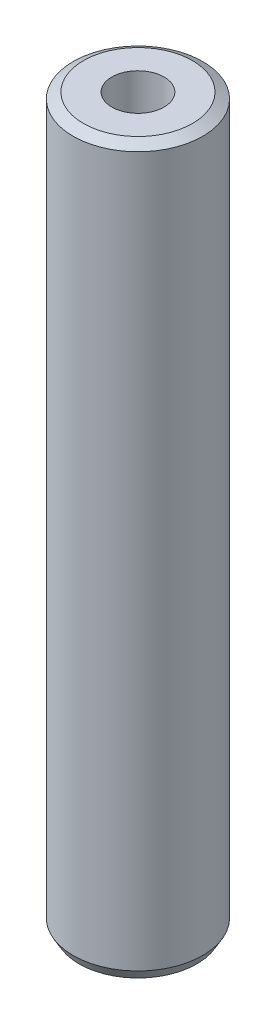
ISO-10303-21;
HEADER;
FILE_DESCRIPTION(('STEP AP214'),'2;1');
FILE_NAME('part.step','',(''),(''),'','','');
FILE_SCHEMA(('AUTOMOTIVE_DESIGN { 1 0 10303 214 1 1 1 1 }'));
ENDSEC;
DATA;
#1=APPLICATION_CONTEXT('core data for automotive mechanical design processes');
#2=APPLICATION_PROTOCOL_DEFINITION('international standard','automotive_design',2000,#1);
#3=PRODUCT_CONTEXT('',#1,'mechanical');
#4=PRODUCT('Part','Part','',(#3));
#5=PRODUCT_RELATED_PRODUCT_CATEGORY('part','',(#4));
#6=PRODUCT_DEFINITION_FORMATION('','',#4);
#7=PRODUCT_DEFINITION_CONTEXT('part definition',#1,'design');
#8=PRODUCT_DEFINITION('design','',#6,#7);
#9=PRODUCT_DEFINITION_SHAPE('','',#8);
#10=(LENGTH_UNIT() NAMED_UNIT(*) SI_UNIT(.MILLI.,.METRE.));
#11=(NAMED_UNIT(*) PLANE_ANGLE_UNIT() SI_UNIT($,.RADIAN.));
#12=(NAMED_UNIT(*) SI_UNIT($,.STERADIAN.) SOLID_ANGLE_UNIT());
#13=UNCERTAINTY_MEASURE_WITH_UNIT(LENGTH_MEASURE(1.E-05),#10,'distance_accuracy_value','');
#14=(GEOMETRIC_REPRESENTATION_CONTEXT(3) GLOBAL_UNCERTAINTY_ASSIGNED_CONTEXT((#13)) GLOBAL_UNIT_ASSIGNED_CONTEXT((#10,
#11,#12)) REPRESENTATION_CONTEXT('',''));
#15=CARTESIAN_POINT('',(0.,0.,0.));
#16=DIRECTION('',(0.,0.,1.));
#17=DIRECTION('',(1.,0.,0.));
#18=AXIS2_PLACEMENT_3D('',#15,#16,#17);
#19=CARTESIAN_POINT('',(0.,419.983161328483,0.));
#20=DIRECTION('',(0.,-1.,0.));
#21=DIRECTION('',(0.,0.,-1.));
#22=AXIS2_PLACEMENT_3D('',#19,#20,#21);
#23=CYLINDRICAL_SURFACE('',#22,37.5);
#24=CARTESIAN_POINT('',(0.,416.544169788002,0.));
#25=DIRECTION('',(0.,1.,0.));
#26=DIRECTION('',(0.,0.,1.));
#27=AXIS2_PLACEMENT_3D('',#24,#25,#26);
#28=CIRCLE('',#27,37.5);
#29=CARTESIAN_POINT('',(0.,416.544169788002,37.5));
#30=VERTEX_POINT('',#29);
#31=EDGE_CURVE('E50',#30,#30,#28,.F.);
#32=ORIENTED_EDGE('',*,*,#31,.T.);
#33=EDGE_LOOP('',(#32));
#34=FACE_BOUND('',#33,.T.);
#35=CARTESIAN_POINT('',(0.,5.95650807491305,0.));
#36=DIRECTION('',(0.,1.,0.));
#37=DIRECTION('',(0.,0.,1.));
#38=AXIS2_PLACEMENT_3D('',#35,#36,#37);
#39=CIRCLE('',#38,37.5);
#40=CARTESIAN_POINT('',(0.,5.95650807491305,37.5));
#41=VERTEX_POINT('',#40);
#42=EDGE_CURVE('E51',#41,#41,#39,.T.);
#43=ORIENTED_EDGE('',*,*,#42,.T.);
#44=EDGE_LOOP('',(#43));
#45=FACE_BOUND('',#44,.T.);
#46=ADVANCED_FACE('F39',(#34,#45),#23,.T.);
#47=CARTESIAN_POINT('',(0.,419.983161328483,0.));
#48=DIRECTION('',(0.,1.,0.));
#49=DIRECTION('',(0.,0.,1.));
#50=AXIS2_PLACEMENT_3D('',#47,#48,#49);
#51=PLANE('',#50);
#52=CARTESIAN_POINT('',(0.,419.983161328483,0.));
#53=DIRECTION('',(0.,1.,0.));
#54=DIRECTION('',(0.,0.,1.));
#55=AXIS2_PLACEMENT_3D('',#52,#53,#54);
#56=CIRCLE('',#55,31.5434919250871);
#57=CARTESIAN_POINT('',(0.,419.983161328483,31.5434919250871));
#58=VERTEX_POINT('',#57);
#59=EDGE_CURVE('E54',#58,#58,#56,.T.);
#60=ORIENTED_EDGE('',*,*,#59,.T.);
#61=EDGE_LOOP('',(#60));
#62=FACE_BOUND('',#61,.T.);
#63=CARTESIAN_POINT('',(0.,419.983161328483,0.));
#64=DIRECTION('',(0.,1.,0.));
#65=DIRECTION('',(0.,0.,1.));
#66=AXIS2_PLACEMENT_3D('',#63,#64,#65);
#67=CIRCLE('',#66,15.1141552496247);
#68=CARTESIAN_POINT('',(0.,419.983161328483,15.1141552496247));
#69=VERTEX_POINT('',#68);
#70=EDGE_CURVE('E58',#69,#69,#67,.T.);
#71=ORIENTED_EDGE('',*,*,#70,.F.);
#72=EDGE_LOOP('',(#71));
#73=FACE_BOUND('',#72,.T.);
#74=ADVANCED_FACE('F69',(#62,#73),#51,.T.);
#75=CARTESIAN_POINT('',(0.,0.,0.));
#76=DIRECTION('',(0.,1.,0.));
#77=DIRECTION('',(0.,0.,1.));
#78=AXIS2_PLACEMENT_3D('',#75,#76,#77);
#79=PLANE('',#78);
#80=CARTESIAN_POINT('',(0.,0.,0.));
#81=DIRECTION('',(0.,1.,0.));
#82=DIRECTION('',(0.,0.,1.));
#83=AXIS2_PLACEMENT_3D('',#80,#81,#82);
#84=CIRCLE('',#83,34.0610084595188);
#85=CARTESIAN_POINT('',(0.,0.,34.0610084595188));
#86=VERTEX_POINT('',#85);
#87=EDGE_CURVE('E10',#86,#86,#84,.F.);
#88=ORIENTED_EDGE('',*,*,#87,.T.);
#89=EDGE_LOOP('',(#88));
#90=FACE_BOUND('',#89,.T.);
#91=CARTESIAN_POINT('',(0.,0.,0.));
#92=DIRECTION('',(0.,1.,0.));
#93=DIRECTION('',(0.,0.,1.));
#94=AXIS2_PLACEMENT_3D('',#91,#92,#93);
#95=CIRCLE('',#94,15.1141552496247);
#96=CARTESIAN_POINT('',(0.,0.,15.1141552496247));
#97=VERTEX_POINT('',#96);
#98=EDGE_CURVE('E63',#97,#97,#95,.T.);
#99=ORIENTED_EDGE('',*,*,#98,.T.);
#100=EDGE_LOOP('',(#99));
#101=FACE_BOUND('',#100,.T.);
#102=ADVANCED_FACE('F75',(#90,#101),#79,.F.);
#103=CARTESIAN_POINT('',(0.,419.983161328483,0.));
#104=DIRECTION('',(0.,-1.,0.));
#105=DIRECTION('',(0.,0.,-1.));
#106=AXIS2_PLACEMENT_3D('',#103,#104,#105);
#107=CYLINDRICAL_SURFACE('',#106,15.1141552496247);
#108=ORIENTED_EDGE('',*,*,#70,.T.);
#109=EDGE_LOOP('',(#108));
#110=FACE_BOUND('',#109,.T.);
#111=ORIENTED_EDGE('',*,*,#98,.F.);
#112=EDGE_LOOP('',(#111));
#113=FACE_BOUND('',#112,.T.);
#114=ADVANCED_FACE('F70',(#110,#113),#107,.F.);
#115=CARTESIAN_POINT('',(0.,419.983161328483,0.));
#116=DIRECTION('',(0.,-1.,0.));
#117=DIRECTION('',(0.,0.,-1.));
#118=AXIS2_PLACEMENT_3D('',#115,#116,#117);
#119=CONICAL_SURFACE('',#118,31.5434919250871,1.0471975511966);
#120=ORIENTED_EDGE('',*,*,#31,.F.);
#121=EDGE_LOOP('',(#120));
#122=FACE_BOUND('',#121,.T.);
#123=ORIENTED_EDGE('',*,*,#59,.F.);
#124=EDGE_LOOP('',(#123));
#125=FACE_BOUND('',#124,.T.);
#126=ADVANCED_FACE('F81',(#122,#125),#119,.T.);
#127=CARTESIAN_POINT('',(0.,5.95650807491305,0.));
#128=DIRECTION('',(0.,1.,0.));
#129=DIRECTION('',(0.,0.,1.));
#130=AXIS2_PLACEMENT_3D('',#127,#128,#129);
#131=CONICAL_SURFACE('',#130,37.5,0.523598775598301);
#132=ORIENTED_EDGE('',*,*,#87,.F.);
#133=EDGE_LOOP('',(#132));
#134=FACE_BOUND('',#133,.T.);
#135=ORIENTED_EDGE('',*,*,#42,.F.);
#136=EDGE_LOOP('',(#135));
#137=FACE_BOUND('',#136,.T.);
#138=ADVANCED_FACE('F45',(#134,#137),#131,.T.);
#139=CLOSED_SHELL('',(#46,#74,#102,#114,#126,#138));
#140=MANIFOLD_SOLID_BREP('B2',#139);
#141=ADVANCED_BREP_SHAPE_REPRESENTATION('',(#18,#140),#14);
#142=SHAPE_DEFINITION_REPRESENTATION(#9,#141);
ENDSEC;
END-ISO-10303-21;
